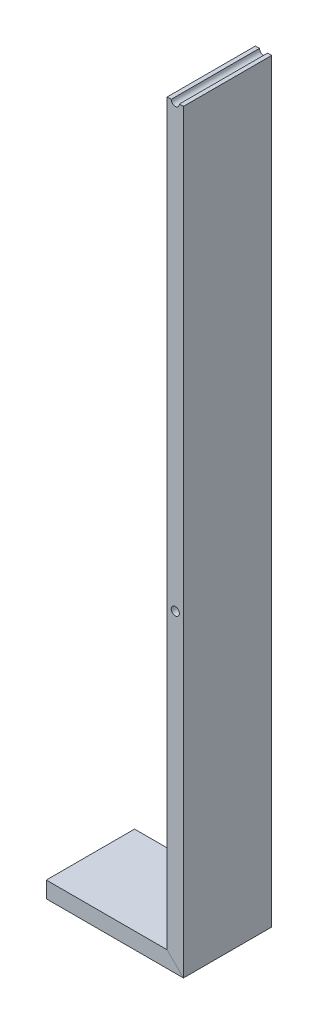
ISO-10303-21;
HEADER;
FILE_DESCRIPTION(('STEP AP214'),'2;1');
FILE_NAME('part.step','',(''),(''),'','','');
FILE_SCHEMA(('AUTOMOTIVE_DESIGN { 1 0 10303 214 1 1 1 1 }'));
ENDSEC;
DATA;
#1=APPLICATION_CONTEXT('core data for automotive mechanical design processes');
#2=APPLICATION_PROTOCOL_DEFINITION('international standard','automotive_design',2000,#1);
#3=PRODUCT_CONTEXT('',#1,'mechanical');
#4=PRODUCT('Part','Part','',(#3));
#5=PRODUCT_RELATED_PRODUCT_CATEGORY('part','',(#4));
#6=PRODUCT_DEFINITION_FORMATION('','',#4);
#7=PRODUCT_DEFINITION_CONTEXT('part definition',#1,'design');
#8=PRODUCT_DEFINITION('design','',#6,#7);
#9=PRODUCT_DEFINITION_SHAPE('','',#8);
#10=(LENGTH_UNIT() NAMED_UNIT(*) SI_UNIT(.MILLI.,.METRE.));
#11=(NAMED_UNIT(*) PLANE_ANGLE_UNIT() SI_UNIT($,.RADIAN.));
#12=(NAMED_UNIT(*) SI_UNIT($,.STERADIAN.) SOLID_ANGLE_UNIT());
#13=UNCERTAINTY_MEASURE_WITH_UNIT(LENGTH_MEASURE(1.E-05),#10,'distance_accuracy_value','');
#14=(GEOMETRIC_REPRESENTATION_CONTEXT(3) GLOBAL_UNCERTAINTY_ASSIGNED_CONTEXT((#13)) GLOBAL_UNIT_ASSIGNED_CONTEXT((#10,
#11,#12)) REPRESENTATION_CONTEXT('',''));
#15=CARTESIAN_POINT('',(0.,0.,0.));
#16=DIRECTION('',(0.,0.,1.));
#17=DIRECTION('',(1.,0.,0.));
#18=AXIS2_PLACEMENT_3D('',#15,#16,#17);
#19=CARTESIAN_POINT('',(190.,1100.,0.));
#20=DIRECTION('',(0.,1.,0.));
#21=DIRECTION('',(0.,0.,-1.));
#22=AXIS2_PLACEMENT_3D('',#19,#20,#21);
#23=PLANE('',#22);
#24=DIRECTION('',(0.,0.,1.));
#25=VECTOR('',#24,1.);
#26=CARTESIAN_POINT('',(184.,1100.,-65.));
#27=LINE('',#26,#25);
#28=CARTESIAN_POINT('',(184.,1100.,-65.));
#29=VERTEX_POINT('',#28);
#30=CARTESIAN_POINT('',(184.,1100.,65.));
#31=VERTEX_POINT('',#30);
#32=EDGE_CURVE('E54',#29,#31,#27,.T.);
#33=ORIENTED_EDGE('',*,*,#32,.F.);
#34=DIRECTION('',(-1.,0.,0.));
#35=VECTOR('',#34,1.);
#36=CARTESIAN_POINT('',(202.,1100.,-65.));
#37=LINE('',#36,#35);
#38=CARTESIAN_POINT('',(178.,1100.,-65.));
#39=VERTEX_POINT('',#38);
#40=EDGE_CURVE('E178',#29,#39,#37,.T.);
#41=ORIENTED_EDGE('',*,*,#40,.T.);
#42=DIRECTION('',(0.,0.,1.));
#43=VECTOR('',#42,1.);
#44=CARTESIAN_POINT('',(178.,1100.,-65.));
#45=LINE('',#44,#43);
#46=CARTESIAN_POINT('',(178.,1100.,65.));
#47=VERTEX_POINT('',#46);
#48=EDGE_CURVE('E175',#39,#47,#45,.T.);
#49=ORIENTED_EDGE('',*,*,#48,.T.);
#50=DIRECTION('',(1.,0.,0.));
#51=VECTOR('',#50,1.);
#52=CARTESIAN_POINT('',(202.,1100.,65.));
#53=LINE('',#52,#51);
#54=EDGE_CURVE('E171',#47,#31,#53,.T.);
#55=ORIENTED_EDGE('',*,*,#54,.T.);
#56=EDGE_LOOP('',(#33,#41,#49,#55));
#57=FACE_BOUND('',#56,.T.);
#58=ADVANCED_FACE('F39',(#57),#23,.T.);
#59=DIRECTION('',(0.,0.,1.));
#60=VECTOR('',#59,1.);
#61=CARTESIAN_POINT('',(196.,1100.,-65.));
#62=LINE('',#61,#60);
#63=CARTESIAN_POINT('',(196.,1100.,65.));
#64=VERTEX_POINT('',#63);
#65=CARTESIAN_POINT('',(196.,1100.,-65.));
#66=VERTEX_POINT('',#65);
#67=EDGE_CURVE('E203',#64,#66,#62,.F.);
#68=ORIENTED_EDGE('',*,*,#67,.F.);
#69=CARTESIAN_POINT('',(202.,1100.,65.));
#70=VERTEX_POINT('',#69);
#71=EDGE_CURVE('E170',#64,#70,#53,.T.);
#72=ORIENTED_EDGE('',*,*,#71,.T.);
#73=DIRECTION('',(0.,0.,-1.));
#74=VECTOR('',#73,1.);
#75=CARTESIAN_POINT('',(202.,1100.,-65.));
#76=LINE('',#75,#74);
#77=CARTESIAN_POINT('',(202.,1100.,-65.));
#78=VERTEX_POINT('',#77);
#79=EDGE_CURVE('E84',#70,#78,#76,.T.);
#80=ORIENTED_EDGE('',*,*,#79,.T.);
#81=EDGE_CURVE('E131',#78,#66,#37,.T.);
#82=ORIENTED_EDGE('',*,*,#81,.T.);
#83=EDGE_LOOP('',(#68,#72,#80,#82));
#84=FACE_BOUND('',#83,.T.);
#85=ADVANCED_FACE('F41',(#84),#23,.T.);
#86=CARTESIAN_POINT('',(0.,0.,0.));
#87=DIRECTION('',(1.,0.,0.));
#88=DIRECTION('',(0.,0.,-1.));
#89=AXIS2_PLACEMENT_3D('',#86,#87,#88);
#90=PLANE('',#89);
#91=DIRECTION('',(0.,-1.,0.));
#92=VECTOR('',#91,1.);
#93=CARTESIAN_POINT('',(0.,-12.,65.));
#94=LINE('',#93,#92);
#95=CARTESIAN_POINT('',(0.,12.,65.));
#96=VERTEX_POINT('',#95);
#97=CARTESIAN_POINT('',(0.,-12.,65.));
#98=VERTEX_POINT('',#97);
#99=EDGE_CURVE('E152',#96,#98,#94,.T.);
#100=ORIENTED_EDGE('',*,*,#99,.F.);
#101=DIRECTION('',(0.,0.,1.));
#102=VECTOR('',#101,1.);
#103=CARTESIAN_POINT('',(0.,12.,-65.));
#104=LINE('',#103,#102);
#105=CARTESIAN_POINT('',(0.,12.,-65.));
#106=VERTEX_POINT('',#105);
#107=EDGE_CURVE('E156',#106,#96,#104,.T.);
#108=ORIENTED_EDGE('',*,*,#107,.F.);
#109=DIRECTION('',(0.,1.,0.));
#110=VECTOR('',#109,1.);
#111=CARTESIAN_POINT('',(0.,-12.,-65.));
#112=LINE('',#111,#110);
#113=CARTESIAN_POINT('',(0.,-12.,-65.));
#114=VERTEX_POINT('',#113);
#115=EDGE_CURVE('E93',#114,#106,#112,.T.);
#116=ORIENTED_EDGE('',*,*,#115,.F.);
#117=DIRECTION('',(0.,0.,-1.));
#118=VECTOR('',#117,1.);
#119=CARTESIAN_POINT('',(0.,-12.,-65.));
#120=LINE('',#119,#118);
#121=EDGE_CURVE('E145',#98,#114,#120,.T.);
#122=ORIENTED_EDGE('',*,*,#121,.F.);
#123=EDGE_LOOP('',(#100,#108,#116,#122));
#124=FACE_BOUND('',#123,.T.);
#125=ADVANCED_FACE('F230',(#124),#90,.F.);
#126=CARTESIAN_POINT('',(202.,-13.3,-65.));
#127=DIRECTION('',(0.,0.,-1.));
#128=DIRECTION('',(-1.,0.,0.));
#129=AXIS2_PLACEMENT_3D('',#126,#127,#128);
#130=PLANE('',#129);
#131=CARTESIAN_POINT('',(190.,1100.,-65.));
#132=DIRECTION('',(0.,0.,1.));
#133=DIRECTION('',(1.,0.,0.));
#134=AXIS2_PLACEMENT_3D('',#131,#132,#133);
#135=CIRCLE('',#134,6.00000000000002);
#136=EDGE_CURVE('E207',#29,#66,#135,.T.);
#137=ORIENTED_EDGE('',*,*,#136,.T.);
#138=ORIENTED_EDGE('',*,*,#81,.F.);
#139=DIRECTION('',(0.,1.,0.));
#140=VECTOR('',#139,1.);
#141=CARTESIAN_POINT('',(202.,-13.3,-65.));
#142=LINE('',#141,#140);
#143=CARTESIAN_POINT('',(202.,-12.,-65.));
#144=VERTEX_POINT('',#143);
#145=EDGE_CURVE('E114',#144,#78,#142,.T.);
#146=ORIENTED_EDGE('',*,*,#145,.F.);
#147=DIRECTION('',(0.707106781186548,-0.707106781186548,0.));
#148=VECTOR('',#147,1.);
#149=CARTESIAN_POINT('',(101.,89.,-65.));
#150=LINE('',#149,#148);
#151=CARTESIAN_POINT('',(178.,12.,-65.));
#152=VERTEX_POINT('',#151);
#153=EDGE_CURVE('E123',#152,#144,#150,.T.);
#154=ORIENTED_EDGE('',*,*,#153,.F.);
#155=DIRECTION('',(0.,1.,0.));
#156=VECTOR('',#155,1.);
#157=CARTESIAN_POINT('',(178.,-13.3,-65.));
#158=LINE('',#157,#156);
#159=EDGE_CURVE('E133',#152,#39,#158,.T.);
#160=ORIENTED_EDGE('',*,*,#159,.T.);
#161=ORIENTED_EDGE('',*,*,#40,.F.);
#162=EDGE_LOOP('',(#137,#138,#146,#154,#160,#161));
#163=FACE_BOUND('',#162,.T.);
#164=CARTESIAN_POINT('',(190.,450.,-65.));
#165=DIRECTION('',(0.,0.,1.));
#166=DIRECTION('',(1.,0.,0.));
#167=AXIS2_PLACEMENT_3D('',#164,#165,#166);
#168=CIRCLE('',#167,6.00000000000002);
#169=CARTESIAN_POINT('',(196.,450.,-65.));
#170=VERTEX_POINT('',#169);
#171=EDGE_CURVE('E212',#170,#170,#168,.T.);
#172=ORIENTED_EDGE('',*,*,#171,.T.);
#173=EDGE_LOOP('',(#172));
#174=FACE_BOUND('',#173,.T.);
#175=ADVANCED_FACE('F128',(#163,#174),#130,.T.);
#176=CARTESIAN_POINT('',(178.,-13.3,-65.));
#177=DIRECTION('',(-1.,0.,0.));
#178=DIRECTION('',(0.,0.,1.));
#179=AXIS2_PLACEMENT_3D('',#176,#177,#178);
#180=PLANE('',#179);
#181=DIRECTION('',(0.,0.,-1.));
#182=VECTOR('',#181,1.);
#183=CARTESIAN_POINT('',(178.,12.,-65.));
#184=LINE('',#183,#182);
#185=CARTESIAN_POINT('',(178.,12.,65.));
#186=VERTEX_POINT('',#185);
#187=EDGE_CURVE('E48',#186,#152,#184,.T.);
#188=ORIENTED_EDGE('',*,*,#187,.F.);
#189=DIRECTION('',(0.,1.,0.));
#190=VECTOR('',#189,1.);
#191=CARTESIAN_POINT('',(178.,-13.3,65.));
#192=LINE('',#191,#190);
#193=EDGE_CURVE('E183',#186,#47,#192,.T.);
#194=ORIENTED_EDGE('',*,*,#193,.T.);
#195=ORIENTED_EDGE('',*,*,#48,.F.);
#196=ORIENTED_EDGE('',*,*,#159,.F.);
#197=EDGE_LOOP('',(#188,#194,#195,#196));
#198=FACE_BOUND('',#197,.T.);
#199=ADVANCED_FACE('F190',(#198),#180,.T.);
#200=CARTESIAN_POINT('',(202.,-13.3,65.));
#201=DIRECTION('',(0.,0.,1.));
#202=DIRECTION('',(1.,0.,0.));
#203=AXIS2_PLACEMENT_3D('',#200,#201,#202);
#204=PLANE('',#203);
#205=CARTESIAN_POINT('',(190.,1100.,65.));
#206=DIRECTION('',(0.,0.,1.));
#207=DIRECTION('',(1.,0.,0.));
#208=AXIS2_PLACEMENT_3D('',#205,#206,#207);
#209=CIRCLE('',#208,6.00000000000002);
#210=EDGE_CURVE('E11',#31,#64,#209,.T.);
#211=ORIENTED_EDGE('',*,*,#210,.F.);
#212=ORIENTED_EDGE('',*,*,#54,.F.);
#213=ORIENTED_EDGE('',*,*,#193,.F.);
#214=DIRECTION('',(-0.707106781186548,0.707106781186548,0.));
#215=VECTOR('',#214,1.);
#216=CARTESIAN_POINT('',(101.,89.,65.));
#217=LINE('',#216,#215);
#218=CARTESIAN_POINT('',(202.,-12.,65.));
#219=VERTEX_POINT('',#218);
#220=EDGE_CURVE('E122',#219,#186,#217,.T.);
#221=ORIENTED_EDGE('',*,*,#220,.F.);
#222=DIRECTION('',(0.,1.,0.));
#223=VECTOR('',#222,1.);
#224=CARTESIAN_POINT('',(202.,-13.3,65.));
#225=LINE('',#224,#223);
#226=EDGE_CURVE('E116',#219,#70,#225,.T.);
#227=ORIENTED_EDGE('',*,*,#226,.T.);
#228=ORIENTED_EDGE('',*,*,#71,.F.);
#229=EDGE_LOOP('',(#211,#212,#213,#221,#227,#228));
#230=FACE_BOUND('',#229,.T.);
#231=CARTESIAN_POINT('',(190.,450.,65.));
#232=DIRECTION('',(0.,0.,1.));
#233=DIRECTION('',(1.,0.,0.));
#234=AXIS2_PLACEMENT_3D('',#231,#232,#233);
#235=CIRCLE('',#234,6.00000000000002);
#236=CARTESIAN_POINT('',(196.,450.,65.));
#237=VERTEX_POINT('',#236);
#238=EDGE_CURVE('E208',#237,#237,#235,.T.);
#239=ORIENTED_EDGE('',*,*,#238,.F.);
#240=EDGE_LOOP('',(#239));
#241=FACE_BOUND('',#240,.T.);
#242=ADVANCED_FACE('F222',(#230,#241),#204,.T.);
#243=CARTESIAN_POINT('',(202.,-13.3,-65.));
#244=DIRECTION('',(1.,0.,0.));
#245=DIRECTION('',(0.,0.,-1.));
#246=AXIS2_PLACEMENT_3D('',#243,#244,#245);
#247=PLANE('',#246);
#248=DIRECTION('',(0.,0.,1.));
#249=VECTOR('',#248,1.);
#250=CARTESIAN_POINT('',(202.,-12.,-65.));
#251=LINE('',#250,#249);
#252=EDGE_CURVE('E111',#144,#219,#251,.T.);
#253=ORIENTED_EDGE('',*,*,#252,.F.);
#254=ORIENTED_EDGE('',*,*,#145,.T.);
#255=ORIENTED_EDGE('',*,*,#79,.F.);
#256=ORIENTED_EDGE('',*,*,#226,.F.);
#257=EDGE_LOOP('',(#253,#254,#255,#256));
#258=FACE_BOUND('',#257,.T.);
#259=ADVANCED_FACE('F113',(#258),#247,.T.);
#260=CARTESIAN_POINT('',(0.,-12.,-65.));
#261=DIRECTION('',(0.,-1.,0.));
#262=DIRECTION('',(0.,0.,-1.));
#263=AXIS2_PLACEMENT_3D('',#260,#261,#262);
#264=PLANE('',#263);
#265=DIRECTION('',(1.,0.,0.));
#266=VECTOR('',#265,1.);
#267=CARTESIAN_POINT('',(0.,-12.,-65.));
#268=LINE('',#267,#266);
#269=EDGE_CURVE('E138',#114,#144,#268,.T.);
#270=ORIENTED_EDGE('',*,*,#269,.T.);
#271=ORIENTED_EDGE('',*,*,#252,.T.);
#272=DIRECTION('',(1.,0.,0.));
#273=VECTOR('',#272,1.);
#274=CARTESIAN_POINT('',(0.,-12.,65.));
#275=LINE('',#274,#273);
#276=EDGE_CURVE('E142',#98,#219,#275,.T.);
#277=ORIENTED_EDGE('',*,*,#276,.F.);
#278=ORIENTED_EDGE('',*,*,#121,.T.);
#279=EDGE_LOOP('',(#270,#271,#277,#278));
#280=FACE_BOUND('',#279,.T.);
#281=ADVANCED_FACE('F144',(#280),#264,.T.);
#282=CARTESIAN_POINT('',(0.,-12.,65.));
#283=DIRECTION('',(0.,0.,1.));
#284=DIRECTION('',(1.,0.,0.));
#285=AXIS2_PLACEMENT_3D('',#282,#283,#284);
#286=PLANE('',#285);
#287=ORIENTED_EDGE('',*,*,#276,.T.);
#288=ORIENTED_EDGE('',*,*,#220,.T.);
#289=DIRECTION('',(1.,0.,0.));
#290=VECTOR('',#289,1.);
#291=CARTESIAN_POINT('',(0.,12.,65.));
#292=LINE('',#291,#290);
#293=EDGE_CURVE('E150',#96,#186,#292,.T.);
#294=ORIENTED_EDGE('',*,*,#293,.F.);
#295=ORIENTED_EDGE('',*,*,#99,.T.);
#296=EDGE_LOOP('',(#287,#288,#294,#295));
#297=FACE_BOUND('',#296,.T.);
#298=ADVANCED_FACE('F229',(#297),#286,.T.);
#299=CARTESIAN_POINT('',(0.,12.,-65.));
#300=DIRECTION('',(0.,1.,0.));
#301=DIRECTION('',(0.,0.,1.));
#302=AXIS2_PLACEMENT_3D('',#299,#300,#301);
#303=PLANE('',#302);
#304=ORIENTED_EDGE('',*,*,#293,.T.);
#305=ORIENTED_EDGE('',*,*,#187,.T.);
#306=DIRECTION('',(1.,0.,0.));
#307=VECTOR('',#306,1.);
#308=CARTESIAN_POINT('',(0.,12.,-65.));
#309=LINE('',#308,#307);
#310=EDGE_CURVE('E140',#106,#152,#309,.T.);
#311=ORIENTED_EDGE('',*,*,#310,.F.);
#312=ORIENTED_EDGE('',*,*,#107,.T.);
#313=EDGE_LOOP('',(#304,#305,#311,#312));
#314=FACE_BOUND('',#313,.T.);
#315=ADVANCED_FACE('F192',(#314),#303,.T.);
#316=CARTESIAN_POINT('',(0.,-12.,-65.));
#317=DIRECTION('',(0.,0.,-1.));
#318=DIRECTION('',(-1.,0.,0.));
#319=AXIS2_PLACEMENT_3D('',#316,#317,#318);
#320=PLANE('',#319);
#321=ORIENTED_EDGE('',*,*,#310,.T.);
#322=ORIENTED_EDGE('',*,*,#153,.T.);
#323=ORIENTED_EDGE('',*,*,#269,.F.);
#324=ORIENTED_EDGE('',*,*,#115,.T.);
#325=EDGE_LOOP('',(#321,#322,#323,#324));
#326=FACE_BOUND('',#325,.T.);
#327=ADVANCED_FACE('F137',(#326),#320,.T.);
#328=CARTESIAN_POINT('',(190.,450.,-65.));
#329=DIRECTION('',(0.,0.,1.));
#330=DIRECTION('',(1.,0.,0.));
#331=AXIS2_PLACEMENT_3D('',#328,#329,#330);
#332=CYLINDRICAL_SURFACE('',#331,6.00000000000002);
#333=ORIENTED_EDGE('',*,*,#171,.F.);
#334=EDGE_LOOP('',(#333));
#335=FACE_BOUND('',#334,.T.);
#336=ORIENTED_EDGE('',*,*,#238,.T.);
#337=EDGE_LOOP('',(#336));
#338=FACE_BOUND('',#337,.T.);
#339=ADVANCED_FACE('F237',(#335,#338),#332,.F.);
#340=CARTESIAN_POINT('',(190.,1100.,-65.));
#341=DIRECTION('',(0.,0.,1.));
#342=DIRECTION('',(1.,0.,0.));
#343=AXIS2_PLACEMENT_3D('',#340,#341,#342);
#344=CYLINDRICAL_SURFACE('',#343,6.00000000000002);
#345=ORIENTED_EDGE('',*,*,#32,.T.);
#346=ORIENTED_EDGE('',*,*,#210,.T.);
#347=ORIENTED_EDGE('',*,*,#67,.T.);
#348=ORIENTED_EDGE('',*,*,#136,.F.);
#349=EDGE_LOOP('',(#345,#346,#347,#348));
#350=FACE_BOUND('',#349,.T.);
#351=ADVANCED_FACE('F248',(#350),#344,.F.);
#352=CLOSED_SHELL('',(#58,#85,#125,#175,#199,#242,#259,#281,#298,#315,#327,#339,#351));
#353=MANIFOLD_SOLID_BREP('B2',#352);
#354=ADVANCED_BREP_SHAPE_REPRESENTATION('',(#18,#353),#14);
#355=SHAPE_DEFINITION_REPRESENTATION(#9,#354);
ENDSEC;
END-ISO-10303-21;
